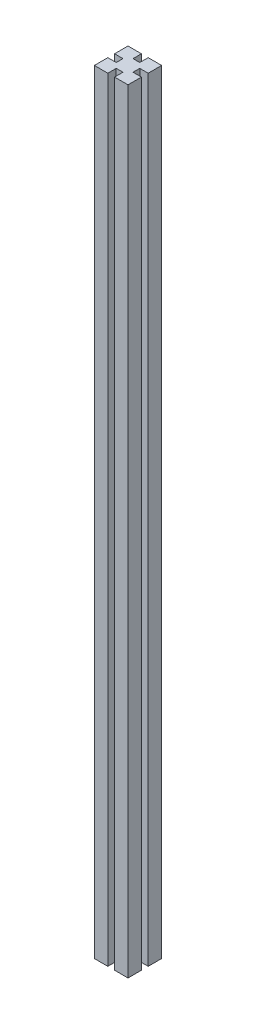
ISO-10303-21;
HEADER;
FILE_DESCRIPTION(('STEP AP214'),'2;1');
FILE_NAME('part.step','',(''),(''),'','','');
FILE_SCHEMA(('AUTOMOTIVE_DESIGN { 1 0 10303 214 1 1 1 1 }'));
ENDSEC;
DATA;
#1=APPLICATION_CONTEXT('core data for automotive mechanical design processes');
#2=APPLICATION_PROTOCOL_DEFINITION('international standard','automotive_design',2000,#1);
#3=PRODUCT_CONTEXT('',#1,'mechanical');
#4=PRODUCT('Part','Part','',(#3));
#5=PRODUCT_RELATED_PRODUCT_CATEGORY('part','',(#4));
#6=PRODUCT_DEFINITION_FORMATION('','',#4);
#7=PRODUCT_DEFINITION_CONTEXT('part definition',#1,'design');
#8=PRODUCT_DEFINITION('design','',#6,#7);
#9=PRODUCT_DEFINITION_SHAPE('','',#8);
#10=(LENGTH_UNIT() NAMED_UNIT(*) SI_UNIT(.MILLI.,.METRE.));
#11=(NAMED_UNIT(*) PLANE_ANGLE_UNIT() SI_UNIT($,.RADIAN.));
#12=(NAMED_UNIT(*) SI_UNIT($,.STERADIAN.) SOLID_ANGLE_UNIT());
#13=UNCERTAINTY_MEASURE_WITH_UNIT(LENGTH_MEASURE(1.E-05),#10,'distance_accuracy_value','');
#14=(GEOMETRIC_REPRESENTATION_CONTEXT(3) GLOBAL_UNCERTAINTY_ASSIGNED_CONTEXT((#13)) GLOBAL_UNIT_ASSIGNED_CONTEXT((#10,
#11,#12)) REPRESENTATION_CONTEXT('',''));
#15=CARTESIAN_POINT('',(0.,0.,0.));
#16=DIRECTION('',(0.,0.,1.));
#17=DIRECTION('',(1.,0.,0.));
#18=AXIS2_PLACEMENT_3D('',#15,#16,#17);
#19=CARTESIAN_POINT('',(5.00000000000001,1150.,25.));
#20=DIRECTION('',(0.,0.,-1.));
#21=DIRECTION('',(-1.,0.,0.));
#22=AXIS2_PLACEMENT_3D('',#19,#20,#21);
#23=PLANE('',#22);
#24=DIRECTION('',(1.,0.,0.));
#25=VECTOR('',#24,1.);
#26=CARTESIAN_POINT('',(5.00000000000001,0.,25.));
#27=LINE('',#26,#25);
#28=CARTESIAN_POINT('',(5.00000000000001,0.,25.));
#29=VERTEX_POINT('',#28);
#30=CARTESIAN_POINT('',(25.,0.,25.));
#31=VERTEX_POINT('',#30);
#32=EDGE_CURVE('E199',#29,#31,#27,.T.);
#33=ORIENTED_EDGE('',*,*,#32,.T.);
#34=DIRECTION('',(0.,-1.,0.));
#35=VECTOR('',#34,1.);
#36=CARTESIAN_POINT('',(25.,1150.,25.));
#37=LINE('',#36,#35);
#38=CARTESIAN_POINT('',(25.,1150.,25.));
#39=VERTEX_POINT('',#38);
#40=EDGE_CURVE('E11',#39,#31,#37,.T.);
#41=ORIENTED_EDGE('',*,*,#40,.F.);
#42=DIRECTION('',(1.,0.,0.));
#43=VECTOR('',#42,1.);
#44=CARTESIAN_POINT('',(5.00000000000001,1150.,25.));
#45=LINE('',#44,#43);
#46=CARTESIAN_POINT('',(5.00000000000001,1150.,25.));
#47=VERTEX_POINT('',#46);
#48=EDGE_CURVE('E254',#47,#39,#45,.T.);
#49=ORIENTED_EDGE('',*,*,#48,.F.);
#50=DIRECTION('',(0.,-1.,0.));
#51=VECTOR('',#50,1.);
#52=CARTESIAN_POINT('',(5.00000000000001,1150.,25.));
#53=LINE('',#52,#51);
#54=EDGE_CURVE('E119',#47,#29,#53,.T.);
#55=ORIENTED_EDGE('',*,*,#54,.T.);
#56=EDGE_LOOP('',(#33,#41,#49,#55));
#57=FACE_BOUND('',#56,.T.);
#58=ADVANCED_FACE('F33',(#57),#23,.F.);
#59=CARTESIAN_POINT('',(25.,1150.,5.));
#60=DIRECTION('',(-1.,0.,0.));
#61=DIRECTION('',(0.,0.,1.));
#62=AXIS2_PLACEMENT_3D('',#59,#60,#61);
#63=PLANE('',#62);
#64=DIRECTION('',(0.,0.,-1.));
#65=VECTOR('',#64,1.);
#66=CARTESIAN_POINT('',(25.,0.,5.));
#67=LINE('',#66,#65);
#68=CARTESIAN_POINT('',(25.,0.,5.));
#69=VERTEX_POINT('',#68);
#70=EDGE_CURVE('E201',#31,#69,#67,.T.);
#71=ORIENTED_EDGE('',*,*,#70,.T.);
#72=DIRECTION('',(0.,-1.,0.));
#73=VECTOR('',#72,1.);
#74=CARTESIAN_POINT('',(25.,1150.,5.));
#75=LINE('',#74,#73);
#76=CARTESIAN_POINT('',(25.,1150.,5.));
#77=VERTEX_POINT('',#76);
#78=EDGE_CURVE('E41',#77,#69,#75,.T.);
#79=ORIENTED_EDGE('',*,*,#78,.F.);
#80=DIRECTION('',(0.,0.,-1.));
#81=VECTOR('',#80,1.);
#82=CARTESIAN_POINT('',(25.,1150.,5.));
#83=LINE('',#82,#81);
#84=EDGE_CURVE('E126',#39,#77,#83,.T.);
#85=ORIENTED_EDGE('',*,*,#84,.F.);
#86=ORIENTED_EDGE('',*,*,#40,.T.);
#87=EDGE_LOOP('',(#71,#79,#85,#86));
#88=FACE_BOUND('',#87,.T.);
#89=ADVANCED_FACE('F293',(#88),#63,.F.);
#90=CARTESIAN_POINT('',(25.,1150.,5.));
#91=DIRECTION('',(0.,0.,1.));
#92=DIRECTION('',(1.,0.,0.));
#93=AXIS2_PLACEMENT_3D('',#90,#91,#92);
#94=PLANE('',#93);
#95=DIRECTION('',(-1.,0.,0.));
#96=VECTOR('',#95,1.);
#97=CARTESIAN_POINT('',(25.,0.,5.));
#98=LINE('',#97,#96);
#99=CARTESIAN_POINT('',(12.5,0.,5.));
#100=VERTEX_POINT('',#99);
#101=EDGE_CURVE('E204',#69,#100,#98,.T.);
#102=ORIENTED_EDGE('',*,*,#101,.T.);
#103=DIRECTION('',(0.,-1.,0.));
#104=VECTOR('',#103,1.);
#105=CARTESIAN_POINT('',(12.5,1150.,5.));
#106=LINE('',#105,#104);
#107=CARTESIAN_POINT('',(12.5,1150.,5.));
#108=VERTEX_POINT('',#107);
#109=EDGE_CURVE('E284',#108,#100,#106,.T.);
#110=ORIENTED_EDGE('',*,*,#109,.F.);
#111=DIRECTION('',(-1.,0.,0.));
#112=VECTOR('',#111,1.);
#113=CARTESIAN_POINT('',(25.,1150.,5.));
#114=LINE('',#113,#112);
#115=EDGE_CURVE('E291',#77,#108,#114,.T.);
#116=ORIENTED_EDGE('',*,*,#115,.F.);
#117=ORIENTED_EDGE('',*,*,#78,.T.);
#118=EDGE_LOOP('',(#102,#110,#116,#117));
#119=FACE_BOUND('',#118,.T.);
#120=ADVANCED_FACE('F287',(#119),#94,.F.);
#121=CARTESIAN_POINT('',(12.5,1150.,-5.));
#122=DIRECTION('',(-1.,0.,0.));
#123=DIRECTION('',(0.,0.,1.));
#124=AXIS2_PLACEMENT_3D('',#121,#122,#123);
#125=PLANE('',#124);
#126=DIRECTION('',(0.,0.,-1.));
#127=VECTOR('',#126,1.);
#128=CARTESIAN_POINT('',(12.5,0.,-5.));
#129=LINE('',#128,#127);
#130=CARTESIAN_POINT('',(12.5,0.,-5.));
#131=VERTEX_POINT('',#130);
#132=EDGE_CURVE('E207',#100,#131,#129,.T.);
#133=ORIENTED_EDGE('',*,*,#132,.T.);
#134=DIRECTION('',(0.,-1.,0.));
#135=VECTOR('',#134,1.);
#136=CARTESIAN_POINT('',(12.5,1150.,-5.));
#137=LINE('',#136,#135);
#138=CARTESIAN_POINT('',(12.5,1150.,-5.));
#139=VERTEX_POINT('',#138);
#140=EDGE_CURVE('E282',#139,#131,#137,.T.);
#141=ORIENTED_EDGE('',*,*,#140,.F.);
#142=DIRECTION('',(0.,0.,-1.));
#143=VECTOR('',#142,1.);
#144=CARTESIAN_POINT('',(12.5,1150.,-5.));
#145=LINE('',#144,#143);
#146=EDGE_CURVE('E305',#108,#139,#145,.T.);
#147=ORIENTED_EDGE('',*,*,#146,.F.);
#148=ORIENTED_EDGE('',*,*,#109,.T.);
#149=EDGE_LOOP('',(#133,#141,#147,#148));
#150=FACE_BOUND('',#149,.T.);
#151=ADVANCED_FACE('F302',(#150),#125,.F.);
#152=CARTESIAN_POINT('',(25.,1150.,-5.));
#153=DIRECTION('',(0.,0.,-1.));
#154=DIRECTION('',(-1.,0.,0.));
#155=AXIS2_PLACEMENT_3D('',#152,#153,#154);
#156=PLANE('',#155);
#157=DIRECTION('',(1.,0.,0.));
#158=VECTOR('',#157,1.);
#159=CARTESIAN_POINT('',(25.,0.,-5.));
#160=LINE('',#159,#158);
#161=CARTESIAN_POINT('',(25.,0.,-5.));
#162=VERTEX_POINT('',#161);
#163=EDGE_CURVE('E210',#131,#162,#160,.T.);
#164=ORIENTED_EDGE('',*,*,#163,.T.);
#165=DIRECTION('',(0.,-1.,0.));
#166=VECTOR('',#165,1.);
#167=CARTESIAN_POINT('',(25.,1150.,-5.));
#168=LINE('',#167,#166);
#169=CARTESIAN_POINT('',(25.,1150.,-5.));
#170=VERTEX_POINT('',#169);
#171=EDGE_CURVE('E280',#170,#162,#168,.T.);
#172=ORIENTED_EDGE('',*,*,#171,.F.);
#173=DIRECTION('',(1.,0.,0.));
#174=VECTOR('',#173,1.);
#175=CARTESIAN_POINT('',(25.,1150.,-5.));
#176=LINE('',#175,#174);
#177=EDGE_CURVE('E306',#139,#170,#176,.T.);
#178=ORIENTED_EDGE('',*,*,#177,.F.);
#179=ORIENTED_EDGE('',*,*,#140,.T.);
#180=EDGE_LOOP('',(#164,#172,#178,#179));
#181=FACE_BOUND('',#180,.T.);
#182=ADVANCED_FACE('F357',(#181),#156,.F.);
#183=CARTESIAN_POINT('',(25.,1150.,-25.));
#184=DIRECTION('',(-1.,0.,0.));
#185=DIRECTION('',(0.,0.,1.));
#186=AXIS2_PLACEMENT_3D('',#183,#184,#185);
#187=PLANE('',#186);
#188=DIRECTION('',(0.,0.,-1.));
#189=VECTOR('',#188,1.);
#190=CARTESIAN_POINT('',(25.,0.,-25.));
#191=LINE('',#190,#189);
#192=CARTESIAN_POINT('',(25.,0.,-25.));
#193=VERTEX_POINT('',#192);
#194=EDGE_CURVE('E213',#162,#193,#191,.T.);
#195=ORIENTED_EDGE('',*,*,#194,.T.);
#196=DIRECTION('',(0.,-1.,0.));
#197=VECTOR('',#196,1.);
#198=CARTESIAN_POINT('',(25.,1150.,-25.));
#199=LINE('',#198,#197);
#200=CARTESIAN_POINT('',(25.,1150.,-25.));
#201=VERTEX_POINT('',#200);
#202=EDGE_CURVE('E278',#201,#193,#199,.T.);
#203=ORIENTED_EDGE('',*,*,#202,.F.);
#204=DIRECTION('',(0.,0.,-1.));
#205=VECTOR('',#204,1.);
#206=CARTESIAN_POINT('',(25.,1150.,-25.));
#207=LINE('',#206,#205);
#208=EDGE_CURVE('E308',#170,#201,#207,.T.);
#209=ORIENTED_EDGE('',*,*,#208,.F.);
#210=ORIENTED_EDGE('',*,*,#171,.T.);
#211=EDGE_LOOP('',(#195,#203,#209,#210));
#212=FACE_BOUND('',#211,.T.);
#213=ADVANCED_FACE('F360',(#212),#187,.F.);
#214=CARTESIAN_POINT('',(5.00000000000001,1150.,-25.));
#215=DIRECTION('',(0.,0.,1.));
#216=DIRECTION('',(1.,0.,0.));
#217=AXIS2_PLACEMENT_3D('',#214,#215,#216);
#218=PLANE('',#217);
#219=DIRECTION('',(-1.,0.,0.));
#220=VECTOR('',#219,1.);
#221=CARTESIAN_POINT('',(5.00000000000001,0.,-25.));
#222=LINE('',#221,#220);
#223=CARTESIAN_POINT('',(5.00000000000001,0.,-25.));
#224=VERTEX_POINT('',#223);
#225=EDGE_CURVE('E216',#193,#224,#222,.T.);
#226=ORIENTED_EDGE('',*,*,#225,.T.);
#227=DIRECTION('',(0.,-1.,0.));
#228=VECTOR('',#227,1.);
#229=CARTESIAN_POINT('',(5.00000000000001,1150.,-25.));
#230=LINE('',#229,#228);
#231=CARTESIAN_POINT('',(5.00000000000001,1150.,-25.));
#232=VERTEX_POINT('',#231);
#233=EDGE_CURVE('E276',#232,#224,#230,.T.);
#234=ORIENTED_EDGE('',*,*,#233,.F.);
#235=DIRECTION('',(-1.,0.,0.));
#236=VECTOR('',#235,1.);
#237=CARTESIAN_POINT('',(5.00000000000001,1150.,-25.));
#238=LINE('',#237,#236);
#239=EDGE_CURVE('E314',#201,#232,#238,.T.);
#240=ORIENTED_EDGE('',*,*,#239,.F.);
#241=ORIENTED_EDGE('',*,*,#202,.T.);
#242=EDGE_LOOP('',(#226,#234,#240,#241));
#243=FACE_BOUND('',#242,.T.);
#244=ADVANCED_FACE('F364',(#243),#218,.F.);
#245=CARTESIAN_POINT('',(5.00000000000001,1150.,-25.));
#246=DIRECTION('',(1.,0.,0.));
#247=DIRECTION('',(0.,0.,-1.));
#248=AXIS2_PLACEMENT_3D('',#245,#246,#247);
#249=PLANE('',#248);
#250=DIRECTION('',(0.,0.,1.));
#251=VECTOR('',#250,1.);
#252=CARTESIAN_POINT('',(5.00000000000001,0.,-25.));
#253=LINE('',#252,#251);
#254=CARTESIAN_POINT('',(5.,0.,-12.5));
#255=VERTEX_POINT('',#254);
#256=EDGE_CURVE('E219',#224,#255,#253,.T.);
#257=ORIENTED_EDGE('',*,*,#256,.T.);
#258=DIRECTION('',(0.,-1.,0.));
#259=VECTOR('',#258,1.);
#260=CARTESIAN_POINT('',(5.,1150.,-12.5));
#261=LINE('',#260,#259);
#262=CARTESIAN_POINT('',(5.,1150.,-12.5));
#263=VERTEX_POINT('',#262);
#264=EDGE_CURVE('E274',#263,#255,#261,.T.);
#265=ORIENTED_EDGE('',*,*,#264,.F.);
#266=DIRECTION('',(0.,0.,1.));
#267=VECTOR('',#266,1.);
#268=CARTESIAN_POINT('',(5.00000000000001,1150.,-25.));
#269=LINE('',#268,#267);
#270=EDGE_CURVE('E316',#232,#263,#269,.T.);
#271=ORIENTED_EDGE('',*,*,#270,.F.);
#272=ORIENTED_EDGE('',*,*,#233,.T.);
#273=EDGE_LOOP('',(#257,#265,#271,#272));
#274=FACE_BOUND('',#273,.T.);
#275=ADVANCED_FACE('F368',(#274),#249,.F.);
#276=CARTESIAN_POINT('',(-5.,1150.,-12.5));
#277=DIRECTION('',(0.,0.,1.));
#278=DIRECTION('',(1.,0.,0.));
#279=AXIS2_PLACEMENT_3D('',#276,#277,#278);
#280=PLANE('',#279);
#281=DIRECTION('',(-1.,0.,0.));
#282=VECTOR('',#281,1.);
#283=CARTESIAN_POINT('',(-5.,0.,-12.5));
#284=LINE('',#283,#282);
#285=CARTESIAN_POINT('',(-5.,0.,-12.5));
#286=VERTEX_POINT('',#285);
#287=EDGE_CURVE('E222',#255,#286,#284,.T.);
#288=ORIENTED_EDGE('',*,*,#287,.T.);
#289=DIRECTION('',(0.,-1.,0.));
#290=VECTOR('',#289,1.);
#291=CARTESIAN_POINT('',(-5.,1150.,-12.5));
#292=LINE('',#291,#290);
#293=CARTESIAN_POINT('',(-5.,1150.,-12.5));
#294=VERTEX_POINT('',#293);
#295=EDGE_CURVE('E272',#294,#286,#292,.T.);
#296=ORIENTED_EDGE('',*,*,#295,.F.);
#297=DIRECTION('',(-1.,0.,0.));
#298=VECTOR('',#297,1.);
#299=CARTESIAN_POINT('',(-5.,1150.,-12.5));
#300=LINE('',#299,#298);
#301=EDGE_CURVE('E318',#263,#294,#300,.T.);
#302=ORIENTED_EDGE('',*,*,#301,.F.);
#303=ORIENTED_EDGE('',*,*,#264,.T.);
#304=EDGE_LOOP('',(#288,#296,#302,#303));
#305=FACE_BOUND('',#304,.T.);
#306=ADVANCED_FACE('F372',(#305),#280,.F.);
#307=CARTESIAN_POINT('',(-5.,1150.,-25.));
#308=DIRECTION('',(-1.,0.,0.));
#309=DIRECTION('',(0.,0.,1.));
#310=AXIS2_PLACEMENT_3D('',#307,#308,#309);
#311=PLANE('',#310);
#312=DIRECTION('',(0.,0.,-1.));
#313=VECTOR('',#312,1.);
#314=CARTESIAN_POINT('',(-5.,0.,-25.));
#315=LINE('',#314,#313);
#316=CARTESIAN_POINT('',(-5.,0.,-25.));
#317=VERTEX_POINT('',#316);
#318=EDGE_CURVE('E225',#286,#317,#315,.T.);
#319=ORIENTED_EDGE('',*,*,#318,.T.);
#320=DIRECTION('',(0.,-1.,0.));
#321=VECTOR('',#320,1.);
#322=CARTESIAN_POINT('',(-5.,1150.,-25.));
#323=LINE('',#322,#321);
#324=CARTESIAN_POINT('',(-5.,1150.,-25.));
#325=VERTEX_POINT('',#324);
#326=EDGE_CURVE('E270',#325,#317,#323,.T.);
#327=ORIENTED_EDGE('',*,*,#326,.F.);
#328=DIRECTION('',(0.,0.,-1.));
#329=VECTOR('',#328,1.);
#330=CARTESIAN_POINT('',(-5.,1150.,-25.));
#331=LINE('',#330,#329);
#332=EDGE_CURVE('E320',#294,#325,#331,.T.);
#333=ORIENTED_EDGE('',*,*,#332,.F.);
#334=ORIENTED_EDGE('',*,*,#295,.T.);
#335=EDGE_LOOP('',(#319,#327,#333,#334));
#336=FACE_BOUND('',#335,.T.);
#337=ADVANCED_FACE('F376',(#336),#311,.F.);
#338=CARTESIAN_POINT('',(-25.,1150.,-25.));
#339=DIRECTION('',(0.,0.,1.));
#340=DIRECTION('',(1.,0.,0.));
#341=AXIS2_PLACEMENT_3D('',#338,#339,#340);
#342=PLANE('',#341);
#343=DIRECTION('',(-1.,0.,0.));
#344=VECTOR('',#343,1.);
#345=CARTESIAN_POINT('',(-25.,0.,-25.));
#346=LINE('',#345,#344);
#347=CARTESIAN_POINT('',(-25.,0.,-25.));
#348=VERTEX_POINT('',#347);
#349=EDGE_CURVE('E228',#317,#348,#346,.T.);
#350=ORIENTED_EDGE('',*,*,#349,.T.);
#351=DIRECTION('',(0.,-1.,0.));
#352=VECTOR('',#351,1.);
#353=CARTESIAN_POINT('',(-25.,1150.,-25.));
#354=LINE('',#353,#352);
#355=CARTESIAN_POINT('',(-25.,1150.,-25.));
#356=VERTEX_POINT('',#355);
#357=EDGE_CURVE('E268',#356,#348,#354,.T.);
#358=ORIENTED_EDGE('',*,*,#357,.F.);
#359=DIRECTION('',(-1.,0.,0.));
#360=VECTOR('',#359,1.);
#361=CARTESIAN_POINT('',(-25.,1150.,-25.));
#362=LINE('',#361,#360);
#363=EDGE_CURVE('E322',#325,#356,#362,.T.);
#364=ORIENTED_EDGE('',*,*,#363,.F.);
#365=ORIENTED_EDGE('',*,*,#326,.T.);
#366=EDGE_LOOP('',(#350,#358,#364,#365));
#367=FACE_BOUND('',#366,.T.);
#368=ADVANCED_FACE('F380',(#367),#342,.F.);
#369=CARTESIAN_POINT('',(-25.,1150.,-25.));
#370=DIRECTION('',(1.,0.,0.));
#371=DIRECTION('',(0.,0.,-1.));
#372=AXIS2_PLACEMENT_3D('',#369,#370,#371);
#373=PLANE('',#372);
#374=DIRECTION('',(0.,0.,1.));
#375=VECTOR('',#374,1.);
#376=CARTESIAN_POINT('',(-25.,0.,-25.));
#377=LINE('',#376,#375);
#378=CARTESIAN_POINT('',(-25.,0.,-4.99999999999999));
#379=VERTEX_POINT('',#378);
#380=EDGE_CURVE('E231',#348,#379,#377,.T.);
#381=ORIENTED_EDGE('',*,*,#380,.T.);
#382=DIRECTION('',(0.,-1.,0.));
#383=VECTOR('',#382,1.);
#384=CARTESIAN_POINT('',(-25.,1150.,-4.99999999999999));
#385=LINE('',#384,#383);
#386=CARTESIAN_POINT('',(-25.,1150.,-4.99999999999999));
#387=VERTEX_POINT('',#386);
#388=EDGE_CURVE('E266',#387,#379,#385,.T.);
#389=ORIENTED_EDGE('',*,*,#388,.F.);
#390=DIRECTION('',(0.,0.,1.));
#391=VECTOR('',#390,1.);
#392=CARTESIAN_POINT('',(-25.,1150.,-25.));
#393=LINE('',#392,#391);
#394=EDGE_CURVE('E324',#356,#387,#393,.T.);
#395=ORIENTED_EDGE('',*,*,#394,.F.);
#396=ORIENTED_EDGE('',*,*,#357,.T.);
#397=EDGE_LOOP('',(#381,#389,#395,#396));
#398=FACE_BOUND('',#397,.T.);
#399=ADVANCED_FACE('F384',(#398),#373,.F.);
#400=CARTESIAN_POINT('',(-25.,1150.,-4.99999999999999));
#401=DIRECTION('',(0.,0.,-1.));
#402=DIRECTION('',(-1.,0.,0.));
#403=AXIS2_PLACEMENT_3D('',#400,#401,#402);
#404=PLANE('',#403);
#405=DIRECTION('',(1.,0.,0.));
#406=VECTOR('',#405,1.);
#407=CARTESIAN_POINT('',(-25.,0.,-4.99999999999999));
#408=LINE('',#407,#406);
#409=CARTESIAN_POINT('',(-12.5,0.,-5.));
#410=VERTEX_POINT('',#409);
#411=EDGE_CURVE('E234',#379,#410,#408,.T.);
#412=ORIENTED_EDGE('',*,*,#411,.T.);
#413=DIRECTION('',(0.,-1.,0.));
#414=VECTOR('',#413,1.);
#415=CARTESIAN_POINT('',(-12.5,1150.,-5.));
#416=LINE('',#415,#414);
#417=CARTESIAN_POINT('',(-12.5,1150.,-5.));
#418=VERTEX_POINT('',#417);
#419=EDGE_CURVE('E264',#418,#410,#416,.T.);
#420=ORIENTED_EDGE('',*,*,#419,.F.);
#421=DIRECTION('',(1.,0.,0.));
#422=VECTOR('',#421,1.);
#423=CARTESIAN_POINT('',(-25.,1150.,-4.99999999999999));
#424=LINE('',#423,#422);
#425=EDGE_CURVE('E326',#387,#418,#424,.T.);
#426=ORIENTED_EDGE('',*,*,#425,.F.);
#427=ORIENTED_EDGE('',*,*,#388,.T.);
#428=EDGE_LOOP('',(#412,#420,#426,#427));
#429=FACE_BOUND('',#428,.T.);
#430=ADVANCED_FACE('F388',(#429),#404,.F.);
#431=CARTESIAN_POINT('',(-12.5,1150.,-5.));
#432=DIRECTION('',(1.,0.,0.));
#433=DIRECTION('',(0.,0.,-1.));
#434=AXIS2_PLACEMENT_3D('',#431,#432,#433);
#435=PLANE('',#434);
#436=DIRECTION('',(0.,0.,1.));
#437=VECTOR('',#436,1.);
#438=CARTESIAN_POINT('',(-12.5,0.,-5.));
#439=LINE('',#438,#437);
#440=CARTESIAN_POINT('',(-12.5,0.,5.));
#441=VERTEX_POINT('',#440);
#442=EDGE_CURVE('E237',#410,#441,#439,.T.);
#443=ORIENTED_EDGE('',*,*,#442,.T.);
#444=DIRECTION('',(0.,-1.,0.));
#445=VECTOR('',#444,1.);
#446=CARTESIAN_POINT('',(-12.5,1150.,5.));
#447=LINE('',#446,#445);
#448=CARTESIAN_POINT('',(-12.5,1150.,5.));
#449=VERTEX_POINT('',#448);
#450=EDGE_CURVE('E262',#449,#441,#447,.T.);
#451=ORIENTED_EDGE('',*,*,#450,.F.);
#452=DIRECTION('',(0.,0.,1.));
#453=VECTOR('',#452,1.);
#454=CARTESIAN_POINT('',(-12.5,1150.,-5.));
#455=LINE('',#454,#453);
#456=EDGE_CURVE('E328',#418,#449,#455,.T.);
#457=ORIENTED_EDGE('',*,*,#456,.F.);
#458=ORIENTED_EDGE('',*,*,#419,.T.);
#459=EDGE_LOOP('',(#443,#451,#457,#458));
#460=FACE_BOUND('',#459,.T.);
#461=ADVANCED_FACE('F392',(#460),#435,.F.);
#462=CARTESIAN_POINT('',(-25.,1150.,5.00000000000001));
#463=DIRECTION('',(0.,0.,1.));
#464=DIRECTION('',(1.,0.,0.));
#465=AXIS2_PLACEMENT_3D('',#462,#463,#464);
#466=PLANE('',#465);
#467=DIRECTION('',(-1.,0.,0.));
#468=VECTOR('',#467,1.);
#469=CARTESIAN_POINT('',(-25.,0.,5.00000000000001));
#470=LINE('',#469,#468);
#471=CARTESIAN_POINT('',(-25.,0.,5.00000000000001));
#472=VERTEX_POINT('',#471);
#473=EDGE_CURVE('E240',#441,#472,#470,.T.);
#474=ORIENTED_EDGE('',*,*,#473,.T.);
#475=DIRECTION('',(0.,-1.,0.));
#476=VECTOR('',#475,1.);
#477=CARTESIAN_POINT('',(-25.,1150.,5.00000000000001));
#478=LINE('',#477,#476);
#479=CARTESIAN_POINT('',(-25.,1150.,5.00000000000001));
#480=VERTEX_POINT('',#479);
#481=EDGE_CURVE('E260',#480,#472,#478,.T.);
#482=ORIENTED_EDGE('',*,*,#481,.F.);
#483=DIRECTION('',(-1.,0.,0.));
#484=VECTOR('',#483,1.);
#485=CARTESIAN_POINT('',(-25.,1150.,5.00000000000001));
#486=LINE('',#485,#484);
#487=EDGE_CURVE('E330',#449,#480,#486,.T.);
#488=ORIENTED_EDGE('',*,*,#487,.F.);
#489=ORIENTED_EDGE('',*,*,#450,.T.);
#490=EDGE_LOOP('',(#474,#482,#488,#489));
#491=FACE_BOUND('',#490,.T.);
#492=ADVANCED_FACE('F396',(#491),#466,.F.);
#493=CARTESIAN_POINT('',(-25.,1150.,5.00000000000001));
#494=DIRECTION('',(1.,0.,0.));
#495=DIRECTION('',(0.,0.,-1.));
#496=AXIS2_PLACEMENT_3D('',#493,#494,#495);
#497=PLANE('',#496);
#498=DIRECTION('',(0.,0.,1.));
#499=VECTOR('',#498,1.);
#500=CARTESIAN_POINT('',(-25.,0.,5.00000000000001));
#501=LINE('',#500,#499);
#502=CARTESIAN_POINT('',(-25.,0.,25.));
#503=VERTEX_POINT('',#502);
#504=EDGE_CURVE('E243',#472,#503,#501,.T.);
#505=ORIENTED_EDGE('',*,*,#504,.T.);
#506=DIRECTION('',(0.,-1.,0.));
#507=VECTOR('',#506,1.);
#508=CARTESIAN_POINT('',(-25.,1150.,25.));
#509=LINE('',#508,#507);
#510=CARTESIAN_POINT('',(-25.,1150.,25.));
#511=VERTEX_POINT('',#510);
#512=EDGE_CURVE('E258',#511,#503,#509,.T.);
#513=ORIENTED_EDGE('',*,*,#512,.F.);
#514=DIRECTION('',(0.,0.,1.));
#515=VECTOR('',#514,1.);
#516=CARTESIAN_POINT('',(-25.,1150.,5.00000000000001));
#517=LINE('',#516,#515);
#518=EDGE_CURVE('E332',#480,#511,#517,.T.);
#519=ORIENTED_EDGE('',*,*,#518,.F.);
#520=ORIENTED_EDGE('',*,*,#481,.T.);
#521=EDGE_LOOP('',(#505,#513,#519,#520));
#522=FACE_BOUND('',#521,.T.);
#523=ADVANCED_FACE('F338',(#522),#497,.F.);
#524=CARTESIAN_POINT('',(-25.,1150.,25.));
#525=DIRECTION('',(0.,0.,-1.));
#526=DIRECTION('',(-1.,0.,0.));
#527=AXIS2_PLACEMENT_3D('',#524,#525,#526);
#528=PLANE('',#527);
#529=DIRECTION('',(1.,0.,0.));
#530=VECTOR('',#529,1.);
#531=CARTESIAN_POINT('',(-25.,0.,25.));
#532=LINE('',#531,#530);
#533=CARTESIAN_POINT('',(-5.,0.,25.));
#534=VERTEX_POINT('',#533);
#535=EDGE_CURVE('E246',#503,#534,#532,.T.);
#536=ORIENTED_EDGE('',*,*,#535,.T.);
#537=DIRECTION('',(0.,-1.,0.));
#538=VECTOR('',#537,1.);
#539=CARTESIAN_POINT('',(-5.,1150.,25.));
#540=LINE('',#539,#538);
#541=CARTESIAN_POINT('',(-5.,1150.,25.));
#542=VERTEX_POINT('',#541);
#543=EDGE_CURVE('E192',#542,#534,#540,.T.);
#544=ORIENTED_EDGE('',*,*,#543,.F.);
#545=DIRECTION('',(1.,0.,0.));
#546=VECTOR('',#545,1.);
#547=CARTESIAN_POINT('',(-25.,1150.,25.));
#548=LINE('',#547,#546);
#549=EDGE_CURVE('E181',#511,#542,#548,.T.);
#550=ORIENTED_EDGE('',*,*,#549,.F.);
#551=ORIENTED_EDGE('',*,*,#512,.T.);
#552=EDGE_LOOP('',(#536,#544,#550,#551));
#553=FACE_BOUND('',#552,.T.);
#554=ADVANCED_FACE('F342',(#553),#528,.F.);
#555=CARTESIAN_POINT('',(-5.,1150.,25.));
#556=DIRECTION('',(-1.,0.,0.));
#557=DIRECTION('',(0.,0.,1.));
#558=AXIS2_PLACEMENT_3D('',#555,#556,#557);
#559=PLANE('',#558);
#560=DIRECTION('',(0.,0.,-1.));
#561=VECTOR('',#560,1.);
#562=CARTESIAN_POINT('',(-5.,0.,25.));
#563=LINE('',#562,#561);
#564=CARTESIAN_POINT('',(-5.,0.,12.5));
#565=VERTEX_POINT('',#564);
#566=EDGE_CURVE('E189',#534,#565,#563,.T.);
#567=ORIENTED_EDGE('',*,*,#566,.T.);
#568=DIRECTION('',(0.,-1.,0.));
#569=VECTOR('',#568,1.);
#570=CARTESIAN_POINT('',(-5.,1150.,12.5));
#571=LINE('',#570,#569);
#572=CARTESIAN_POINT('',(-5.,1150.,12.5));
#573=VERTEX_POINT('',#572);
#574=EDGE_CURVE('E186',#573,#565,#571,.T.);
#575=ORIENTED_EDGE('',*,*,#574,.F.);
#576=DIRECTION('',(0.,0.,-1.));
#577=VECTOR('',#576,1.);
#578=CARTESIAN_POINT('',(-5.,1150.,25.));
#579=LINE('',#578,#577);
#580=EDGE_CURVE('E175',#542,#573,#579,.T.);
#581=ORIENTED_EDGE('',*,*,#580,.F.);
#582=ORIENTED_EDGE('',*,*,#543,.T.);
#583=EDGE_LOOP('',(#567,#575,#581,#582));
#584=FACE_BOUND('',#583,.T.);
#585=ADVANCED_FACE('F187',(#584),#559,.F.);
#586=CARTESIAN_POINT('',(-5.,1150.,12.5));
#587=DIRECTION('',(0.,0.,-1.));
#588=DIRECTION('',(-1.,0.,0.));
#589=AXIS2_PLACEMENT_3D('',#586,#587,#588);
#590=PLANE('',#589);
#591=DIRECTION('',(1.,0.,0.));
#592=VECTOR('',#591,1.);
#593=CARTESIAN_POINT('',(-5.,0.,12.5));
#594=LINE('',#593,#592);
#595=CARTESIAN_POINT('',(5.,0.,12.5));
#596=VERTEX_POINT('',#595);
#597=EDGE_CURVE('E250',#565,#596,#594,.T.);
#598=ORIENTED_EDGE('',*,*,#597,.T.);
#599=DIRECTION('',(0.,-1.,0.));
#600=VECTOR('',#599,1.);
#601=CARTESIAN_POINT('',(5.,1150.,12.5));
#602=LINE('',#601,#600);
#603=CARTESIAN_POINT('',(5.,1150.,12.5));
#604=VERTEX_POINT('',#603);
#605=EDGE_CURVE('E112',#604,#596,#602,.T.);
#606=ORIENTED_EDGE('',*,*,#605,.F.);
#607=DIRECTION('',(1.,0.,0.));
#608=VECTOR('',#607,1.);
#609=CARTESIAN_POINT('',(-5.,1150.,12.5));
#610=LINE('',#609,#608);
#611=EDGE_CURVE('E179',#573,#604,#610,.T.);
#612=ORIENTED_EDGE('',*,*,#611,.F.);
#613=ORIENTED_EDGE('',*,*,#574,.T.);
#614=EDGE_LOOP('',(#598,#606,#612,#613));
#615=FACE_BOUND('',#614,.T.);
#616=ADVANCED_FACE('F194',(#615),#590,.F.);
#617=CARTESIAN_POINT('',(5.00000000000001,1150.,25.));
#618=DIRECTION('',(1.,0.,0.));
#619=DIRECTION('',(0.,0.,-1.));
#620=AXIS2_PLACEMENT_3D('',#617,#618,#619);
#621=PLANE('',#620);
#622=DIRECTION('',(0.,0.,1.));
#623=VECTOR('',#622,1.);
#624=CARTESIAN_POINT('',(5.00000000000001,0.,25.));
#625=LINE('',#624,#623);
#626=EDGE_CURVE('E252',#596,#29,#625,.T.);
#627=ORIENTED_EDGE('',*,*,#626,.T.);
#628=ORIENTED_EDGE('',*,*,#54,.F.);
#629=DIRECTION('',(0.,0.,1.));
#630=VECTOR('',#629,1.);
#631=CARTESIAN_POINT('',(5.00000000000001,1150.,25.));
#632=LINE('',#631,#630);
#633=EDGE_CURVE('E49',#604,#47,#632,.T.);
#634=ORIENTED_EDGE('',*,*,#633,.F.);
#635=ORIENTED_EDGE('',*,*,#605,.T.);
#636=EDGE_LOOP('',(#627,#628,#634,#635));
#637=FACE_BOUND('',#636,.T.);
#638=ADVANCED_FACE('F344',(#637),#621,.F.);
#639=CARTESIAN_POINT('',(0.,1150.,0.));
#640=DIRECTION('',(0.,-1.,0.));
#641=DIRECTION('',(0.,0.,-1.));
#642=AXIS2_PLACEMENT_3D('',#639,#640,#641);
#643=PLANE('',#642);
#644=ORIENTED_EDGE('',*,*,#48,.T.);
#645=ORIENTED_EDGE('',*,*,#84,.T.);
#646=ORIENTED_EDGE('',*,*,#115,.T.);
#647=ORIENTED_EDGE('',*,*,#146,.T.);
#648=ORIENTED_EDGE('',*,*,#177,.T.);
#649=ORIENTED_EDGE('',*,*,#208,.T.);
#650=ORIENTED_EDGE('',*,*,#239,.T.);
#651=ORIENTED_EDGE('',*,*,#270,.T.);
#652=ORIENTED_EDGE('',*,*,#301,.T.);
#653=ORIENTED_EDGE('',*,*,#332,.T.);
#654=ORIENTED_EDGE('',*,*,#363,.T.);
#655=ORIENTED_EDGE('',*,*,#394,.T.);
#656=ORIENTED_EDGE('',*,*,#425,.T.);
#657=ORIENTED_EDGE('',*,*,#456,.T.);
#658=ORIENTED_EDGE('',*,*,#487,.T.);
#659=ORIENTED_EDGE('',*,*,#518,.T.);
#660=ORIENTED_EDGE('',*,*,#549,.T.);
#661=ORIENTED_EDGE('',*,*,#580,.T.);
#662=ORIENTED_EDGE('',*,*,#611,.T.);
#663=ORIENTED_EDGE('',*,*,#633,.T.);
#664=EDGE_LOOP('',(#644,#645,#646,#647,#648,#649,#650,#651,#652,#653,#654,#655,#656,#657,#658,
#659,#660,#661,#662,#663));
#665=FACE_BOUND('',#664,.T.);
#666=ADVANCED_FACE('F177',(#665),#643,.F.);
#667=CARTESIAN_POINT('',(0.,0.,0.));
#668=DIRECTION('',(0.,-1.,0.));
#669=DIRECTION('',(0.,0.,-1.));
#670=AXIS2_PLACEMENT_3D('',#667,#668,#669);
#671=PLANE('',#670);
#672=ORIENTED_EDGE('',*,*,#32,.F.);
#673=ORIENTED_EDGE('',*,*,#626,.F.);
#674=ORIENTED_EDGE('',*,*,#597,.F.);
#675=ORIENTED_EDGE('',*,*,#566,.F.);
#676=ORIENTED_EDGE('',*,*,#535,.F.);
#677=ORIENTED_EDGE('',*,*,#504,.F.);
#678=ORIENTED_EDGE('',*,*,#473,.F.);
#679=ORIENTED_EDGE('',*,*,#442,.F.);
#680=ORIENTED_EDGE('',*,*,#411,.F.);
#681=ORIENTED_EDGE('',*,*,#380,.F.);
#682=ORIENTED_EDGE('',*,*,#349,.F.);
#683=ORIENTED_EDGE('',*,*,#318,.F.);
#684=ORIENTED_EDGE('',*,*,#287,.F.);
#685=ORIENTED_EDGE('',*,*,#256,.F.);
#686=ORIENTED_EDGE('',*,*,#225,.F.);
#687=ORIENTED_EDGE('',*,*,#194,.F.);
#688=ORIENTED_EDGE('',*,*,#163,.F.);
#689=ORIENTED_EDGE('',*,*,#132,.F.);
#690=ORIENTED_EDGE('',*,*,#101,.F.);
#691=ORIENTED_EDGE('',*,*,#70,.F.);
#692=EDGE_LOOP('',(#672,#673,#674,#675,#676,#677,#678,#679,#680,#681,#682,#683,#684,#685,#686,
#687,#688,#689,#690,#691));
#693=FACE_BOUND('',#692,.T.);
#694=ADVANCED_FACE('F297',(#693),#671,.T.);
#695=CLOSED_SHELL('',(#58,#89,#120,#151,#182,#213,#244,#275,#306,#337,#368,#399,#430,#461,#492,
#523,#554,#585,#616,#638,#666,#694));
#696=MANIFOLD_SOLID_BREP('B2',#695);
#697=ADVANCED_BREP_SHAPE_REPRESENTATION('',(#18,#696),#14);
#698=SHAPE_DEFINITION_REPRESENTATION(#9,#697);
ENDSEC;
END-ISO-10303-21;
